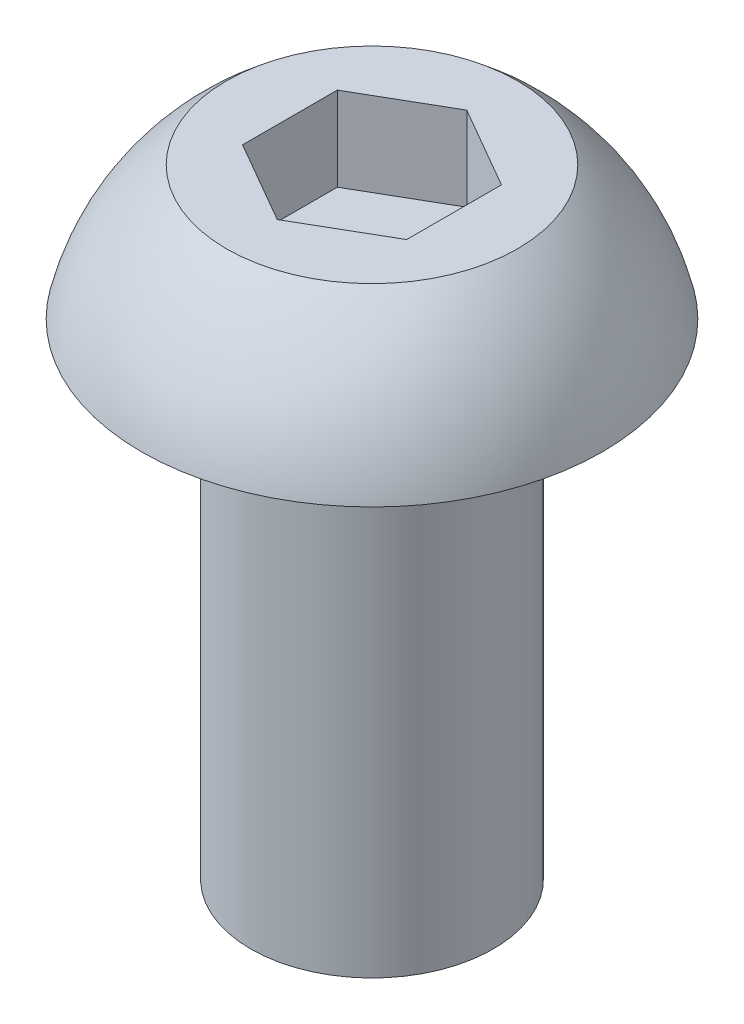
ISO-10303-21;
HEADER;
FILE_DESCRIPTION(('STEP AP214'),'2;1');
FILE_NAME('part.step','',(''),(''),'','','');
FILE_SCHEMA(('AUTOMOTIVE_DESIGN { 1 0 10303 214 1 1 1 1 }'));
ENDSEC;
DATA;
#1=APPLICATION_CONTEXT('core data for automotive mechanical design processes');
#2=APPLICATION_PROTOCOL_DEFINITION('international standard','automotive_design',2000,#1);
#3=PRODUCT_CONTEXT('',#1,'mechanical');
#4=PRODUCT('Part','Part','',(#3));
#5=PRODUCT_RELATED_PRODUCT_CATEGORY('part','',(#4));
#6=PRODUCT_DEFINITION_FORMATION('','',#4);
#7=PRODUCT_DEFINITION_CONTEXT('part definition',#1,'design');
#8=PRODUCT_DEFINITION('design','',#6,#7);
#9=PRODUCT_DEFINITION_SHAPE('','',#8);
#10=(LENGTH_UNIT() NAMED_UNIT(*) SI_UNIT(.MILLI.,.METRE.));
#11=(NAMED_UNIT(*) PLANE_ANGLE_UNIT() SI_UNIT($,.RADIAN.));
#12=(NAMED_UNIT(*) SI_UNIT($,.STERADIAN.) SOLID_ANGLE_UNIT());
#13=UNCERTAINTY_MEASURE_WITH_UNIT(LENGTH_MEASURE(1.E-05),#10,'distance_accuracy_value','');
#14=(GEOMETRIC_REPRESENTATION_CONTEXT(3) GLOBAL_UNCERTAINTY_ASSIGNED_CONTEXT((#13)) GLOBAL_UNIT_ASSIGNED_CONTEXT((#10,
#11,#12)) REPRESENTATION_CONTEXT('',''));
#15=CARTESIAN_POINT('',(0.,0.,0.));
#16=DIRECTION('',(0.,0.,1.));
#17=DIRECTION('',(1.,0.,0.));
#18=AXIS2_PLACEMENT_3D('',#15,#16,#17);
#19=CARTESIAN_POINT('',(0.,0.,0.));
#20=DIRECTION('',(0.,-1.,0.));
#21=DIRECTION('',(-1.,0.,0.));
#22=AXIS2_PLACEMENT_3D('',#19,#20,#21);
#23=SPHERICAL_SURFACE('',#22,2.92419728336959);
#24=CARTESIAN_POINT('',(0.,0.654545454545435,0.));
#25=DIRECTION('',(0.,-1.,0.));
#26=DIRECTION('',(0.,0.,-1.));
#27=AXIS2_PLACEMENT_3D('',#24,#25,#26);
#28=CIRCLE('',#27,2.85);
#29=CARTESIAN_POINT('',(0.,0.654545454545435,-2.85));
#30=VERTEX_POINT('',#29);
#31=EDGE_CURVE('E171',#30,#30,#28,.T.);
#32=ORIENTED_EDGE('',*,*,#31,.F.);
#33=EDGE_LOOP('',(#32));
#34=FACE_BOUND('',#33,.T.);
#35=CARTESIAN_POINT('',(0.,2.30454545454545,0.));
#36=DIRECTION('',(0.,-1.,0.));
#37=DIRECTION('',(0.,0.,-1.));
#38=AXIS2_PLACEMENT_3D('',#35,#36,#37);
#39=CIRCLE('',#38,1.8);
#40=CARTESIAN_POINT('',(0.,2.30454545454545,-1.8));
#41=VERTEX_POINT('',#40);
#42=EDGE_CURVE('E154',#41,#41,#39,.T.);
#43=ORIENTED_EDGE('',*,*,#42,.T.);
#44=EDGE_LOOP('',(#43));
#45=FACE_BOUND('',#44,.T.);
#46=ADVANCED_FACE('F39',(#34,#45),#23,.T.);
#47=CARTESIAN_POINT('',(-2.85,0.654545454545435,0.));
#48=DIRECTION('',(0.,1.,0.));
#49=DIRECTION('',(0.,0.,1.));
#50=AXIS2_PLACEMENT_3D('',#47,#48,#49);
#51=PLANE('',#50);
#52=CARTESIAN_POINT('',(0.,0.654545454545435,0.));
#53=DIRECTION('',(0.,1.,0.));
#54=DIRECTION('',(0.,0.,1.));
#55=AXIS2_PLACEMENT_3D('',#52,#53,#54);
#56=CIRCLE('',#55,1.6);
#57=CARTESIAN_POINT('',(0.,0.654545454545435,1.6));
#58=VERTEX_POINT('',#57);
#59=EDGE_CURVE('E11',#58,#58,#56,.T.);
#60=ORIENTED_EDGE('',*,*,#59,.T.);
#61=EDGE_LOOP('',(#60));
#62=FACE_BOUND('',#61,.T.);
#63=ORIENTED_EDGE('',*,*,#31,.T.);
#64=EDGE_LOOP('',(#63));
#65=FACE_BOUND('',#64,.T.);
#66=ADVANCED_FACE('F190',(#62,#65),#51,.F.);
#67=CARTESIAN_POINT('',(0.,0.,0.));
#68=DIRECTION('',(0.,-1.,0.));
#69=DIRECTION('',(0.,0.,-1.));
#70=AXIS2_PLACEMENT_3D('',#67,#68,#69);
#71=CYLINDRICAL_SURFACE('',#70,1.5);
#72=CARTESIAN_POINT('',(0.,0.554545454545435,0.));
#73=DIRECTION('',(0.,1.,0.));
#74=DIRECTION('',(0.,0.,1.));
#75=AXIS2_PLACEMENT_3D('',#72,#73,#74);
#76=CIRCLE('',#75,1.5);
#77=CARTESIAN_POINT('',(0.,0.554545454545435,1.5));
#78=VERTEX_POINT('',#77);
#79=EDGE_CURVE('E48',#78,#78,#76,.F.);
#80=ORIENTED_EDGE('',*,*,#79,.T.);
#81=EDGE_LOOP('',(#80));
#82=FACE_BOUND('',#81,.T.);
#83=CARTESIAN_POINT('',(0.,-5.34545454545456,0.));
#84=DIRECTION('',(0.,-1.,0.));
#85=DIRECTION('',(0.,0.,-1.));
#86=AXIS2_PLACEMENT_3D('',#83,#84,#85);
#87=CIRCLE('',#86,1.5);
#88=CARTESIAN_POINT('',(0.,-5.34545454545456,-1.5));
#89=VERTEX_POINT('',#88);
#90=EDGE_CURVE('E167',#89,#89,#87,.T.);
#91=ORIENTED_EDGE('',*,*,#90,.F.);
#92=EDGE_LOOP('',(#91));
#93=FACE_BOUND('',#92,.T.);
#94=ADVANCED_FACE('F178',(#82,#93),#71,.T.);
#95=CARTESIAN_POINT('',(0.,-5.34545454545456,0.));
#96=DIRECTION('',(0.,1.,0.));
#97=DIRECTION('',(0.,0.,1.));
#98=AXIS2_PLACEMENT_3D('',#95,#96,#97);
#99=PLANE('',#98);
#100=ORIENTED_EDGE('',*,*,#90,.T.);
#101=EDGE_LOOP('',(#100));
#102=FACE_BOUND('',#101,.T.);
#103=ADVANCED_FACE('F202',(#102),#99,.F.);
#104=CARTESIAN_POINT('',(0.,2.30454545454545,0.));
#105=DIRECTION('',(0.,-1.,0.));
#106=DIRECTION('',(0.,0.,-1.));
#107=AXIS2_PLACEMENT_3D('',#104,#105,#106);
#108=PLANE('',#107);
#109=DIRECTION('',(0.866025403784439,0.,-0.499999999999999));
#110=VECTOR('',#109,1.);
#111=CARTESIAN_POINT('',(0.,2.30454545454545,1.17202104645494));
#112=LINE('',#111,#110);
#113=CARTESIAN_POINT('',(0.,2.30454545454545,1.17202104645494));
#114=VERTEX_POINT('',#113);
#115=CARTESIAN_POINT('',(1.015,2.30454545454545,0.58601052322747));
#116=VERTEX_POINT('',#115);
#117=EDGE_CURVE('E135',#114,#116,#112,.T.);
#118=ORIENTED_EDGE('',*,*,#117,.F.);
#119=DIRECTION('',(0.866025403784439,0.,0.5));
#120=VECTOR('',#119,1.);
#121=CARTESIAN_POINT('',(-1.015,2.30454545454545,0.58601052322747));
#122=LINE('',#121,#120);
#123=CARTESIAN_POINT('',(-1.015,2.30454545454545,0.58601052322747));
#124=VERTEX_POINT('',#123);
#125=EDGE_CURVE('E55',#124,#114,#122,.T.);
#126=ORIENTED_EDGE('',*,*,#125,.F.);
#127=DIRECTION('',(0.,0.,1.));
#128=VECTOR('',#127,1.);
#129=CARTESIAN_POINT('',(-1.015,2.30454545454545,-0.586010523227472));
#130=LINE('',#129,#128);
#131=CARTESIAN_POINT('',(-1.015,2.30454545454545,-0.586010523227472));
#132=VERTEX_POINT('',#131);
#133=EDGE_CURVE('E148',#132,#124,#130,.T.);
#134=ORIENTED_EDGE('',*,*,#133,.F.);
#135=DIRECTION('',(-0.866025403784439,0.,0.499999999999999));
#136=VECTOR('',#135,1.);
#137=CARTESIAN_POINT('',(0.,2.30454545454545,-1.17202104645494));
#138=LINE('',#137,#136);
#139=CARTESIAN_POINT('',(0.,2.30454545454545,-1.17202104645494));
#140=VERTEX_POINT('',#139);
#141=EDGE_CURVE('E145',#140,#132,#138,.T.);
#142=ORIENTED_EDGE('',*,*,#141,.F.);
#143=DIRECTION('',(-0.866025403784439,0.,-0.5));
#144=VECTOR('',#143,1.);
#145=CARTESIAN_POINT('',(1.015,2.30454545454545,-0.586010523227475));
#146=LINE('',#145,#144);
#147=CARTESIAN_POINT('',(1.015,2.30454545454545,-0.586010523227475));
#148=VERTEX_POINT('',#147);
#149=EDGE_CURVE('E103',#148,#140,#146,.T.);
#150=ORIENTED_EDGE('',*,*,#149,.F.);
#151=DIRECTION('',(0.,0.,-1.));
#152=VECTOR('',#151,1.);
#153=CARTESIAN_POINT('',(1.015,2.30454545454545,0.58601052322747));
#154=LINE('',#153,#152);
#155=EDGE_CURVE('E139',#116,#148,#154,.T.);
#156=ORIENTED_EDGE('',*,*,#155,.F.);
#157=EDGE_LOOP('',(#118,#126,#134,#142,#150,#156));
#158=FACE_BOUND('',#157,.T.);
#159=ORIENTED_EDGE('',*,*,#42,.F.);
#160=EDGE_LOOP('',(#159));
#161=FACE_BOUND('',#160,.T.);
#162=ADVANCED_FACE('F205',(#158,#161),#108,.F.);
#163=CARTESIAN_POINT('',(-1.015,1.26454545454545,0.58601052322747));
#164=DIRECTION('',(-0.5,0.,0.866025403784439));
#165=DIRECTION('',(0.866025403784439,0.,0.5));
#166=AXIS2_PLACEMENT_3D('',#163,#164,#165);
#167=PLANE('',#166);
#168=ORIENTED_EDGE('',*,*,#125,.T.);
#169=DIRECTION('',(0.,1.,0.));
#170=VECTOR('',#169,1.);
#171=CARTESIAN_POINT('',(0.,1.26454545454545,1.17202104645494));
#172=LINE('',#171,#170);
#173=CARTESIAN_POINT('',(0.,1.26454545454545,1.17202104645494));
#174=VERTEX_POINT('',#173);
#175=EDGE_CURVE('E85',#174,#114,#172,.T.);
#176=ORIENTED_EDGE('',*,*,#175,.F.);
#177=DIRECTION('',(0.866025403784439,0.,0.5));
#178=VECTOR('',#177,1.);
#179=CARTESIAN_POINT('',(-1.015,1.26454545454545,0.58601052322747));
#180=LINE('',#179,#178);
#181=CARTESIAN_POINT('',(-1.015,1.26454545454545,0.58601052322747));
#182=VERTEX_POINT('',#181);
#183=EDGE_CURVE('E151',#182,#174,#180,.T.);
#184=ORIENTED_EDGE('',*,*,#183,.F.);
#185=DIRECTION('',(0.,1.,0.));
#186=VECTOR('',#185,1.);
#187=CARTESIAN_POINT('',(-1.015,1.26454545454545,0.58601052322747));
#188=LINE('',#187,#186);
#189=EDGE_CURVE('E63',#182,#124,#188,.T.);
#190=ORIENTED_EDGE('',*,*,#189,.T.);
#191=EDGE_LOOP('',(#168,#176,#184,#190));
#192=FACE_BOUND('',#191,.T.);
#193=ADVANCED_FACE('F209',(#192),#167,.F.);
#194=CARTESIAN_POINT('',(-1.015,1.26454545454545,-0.586010523227472));
#195=DIRECTION('',(-1.,0.,0.));
#196=DIRECTION('',(0.,0.,1.));
#197=AXIS2_PLACEMENT_3D('',#194,#195,#196);
#198=PLANE('',#197);
#199=ORIENTED_EDGE('',*,*,#133,.T.);
#200=ORIENTED_EDGE('',*,*,#189,.F.);
#201=DIRECTION('',(0.,0.,1.));
#202=VECTOR('',#201,1.);
#203=CARTESIAN_POINT('',(-1.015,1.26454545454545,-0.586010523227472));
#204=LINE('',#203,#202);
#205=CARTESIAN_POINT('',(-1.015,1.26454545454545,-0.586010523227472));
#206=VERTEX_POINT('',#205);
#207=EDGE_CURVE('E117',#206,#182,#204,.T.);
#208=ORIENTED_EDGE('',*,*,#207,.F.);
#209=DIRECTION('',(0.,1.,0.));
#210=VECTOR('',#209,1.);
#211=CARTESIAN_POINT('',(-1.015,1.26454545454545,-0.586010523227472));
#212=LINE('',#211,#210);
#213=EDGE_CURVE('E108',#206,#132,#212,.T.);
#214=ORIENTED_EDGE('',*,*,#213,.T.);
#215=EDGE_LOOP('',(#199,#200,#208,#214));
#216=FACE_BOUND('',#215,.T.);
#217=ADVANCED_FACE('F213',(#216),#198,.F.);
#218=CARTESIAN_POINT('',(0.,1.26454545454545,-1.17202104645494));
#219=DIRECTION('',(-0.499999999999999,0.,-0.866025403784439));
#220=DIRECTION('',(-0.866025403784439,0.,0.5));
#221=AXIS2_PLACEMENT_3D('',#218,#219,#220);
#222=PLANE('',#221);
#223=ORIENTED_EDGE('',*,*,#141,.T.);
#224=ORIENTED_EDGE('',*,*,#213,.F.);
#225=DIRECTION('',(-0.866025403784439,0.,0.499999999999999));
#226=VECTOR('',#225,1.);
#227=CARTESIAN_POINT('',(0.,1.26454545454545,-1.17202104645494));
#228=LINE('',#227,#226);
#229=CARTESIAN_POINT('',(0.,1.26454545454545,-1.17202104645494));
#230=VERTEX_POINT('',#229);
#231=EDGE_CURVE('E112',#230,#206,#228,.T.);
#232=ORIENTED_EDGE('',*,*,#231,.F.);
#233=DIRECTION('',(0.,1.,0.));
#234=VECTOR('',#233,1.);
#235=CARTESIAN_POINT('',(0.,1.26454545454545,-1.17202104645494));
#236=LINE('',#235,#234);
#237=EDGE_CURVE('E96',#230,#140,#236,.T.);
#238=ORIENTED_EDGE('',*,*,#237,.T.);
#239=EDGE_LOOP('',(#223,#224,#232,#238));
#240=FACE_BOUND('',#239,.T.);
#241=ADVANCED_FACE('F113',(#240),#222,.F.);
#242=CARTESIAN_POINT('',(1.015,1.26454545454545,-0.586010523227475));
#243=DIRECTION('',(0.5,0.,-0.866025403784439));
#244=DIRECTION('',(-0.866025403784439,0.,-0.5));
#245=AXIS2_PLACEMENT_3D('',#242,#243,#244);
#246=PLANE('',#245);
#247=ORIENTED_EDGE('',*,*,#149,.T.);
#248=ORIENTED_EDGE('',*,*,#237,.F.);
#249=DIRECTION('',(-0.866025403784439,0.,-0.5));
#250=VECTOR('',#249,1.);
#251=CARTESIAN_POINT('',(1.015,1.26454545454545,-0.586010523227475));
#252=LINE('',#251,#250);
#253=CARTESIAN_POINT('',(1.015,1.26454545454545,-0.586010523227475));
#254=VERTEX_POINT('',#253);
#255=EDGE_CURVE('E100',#254,#230,#252,.T.);
#256=ORIENTED_EDGE('',*,*,#255,.F.);
#257=DIRECTION('',(0.,1.,0.));
#258=VECTOR('',#257,1.);
#259=CARTESIAN_POINT('',(1.015,1.26454545454545,-0.586010523227475));
#260=LINE('',#259,#258);
#261=EDGE_CURVE('E109',#254,#148,#260,.T.);
#262=ORIENTED_EDGE('',*,*,#261,.T.);
#263=EDGE_LOOP('',(#247,#248,#256,#262));
#264=FACE_BOUND('',#263,.T.);
#265=ADVANCED_FACE('F98',(#264),#246,.F.);
#266=CARTESIAN_POINT('',(1.015,1.26454545454545,0.58601052322747));
#267=DIRECTION('',(1.,0.,0.));
#268=DIRECTION('',(0.,0.,-1.));
#269=AXIS2_PLACEMENT_3D('',#266,#267,#268);
#270=PLANE('',#269);
#271=ORIENTED_EDGE('',*,*,#155,.T.);
#272=ORIENTED_EDGE('',*,*,#261,.F.);
#273=DIRECTION('',(0.,0.,-1.));
#274=VECTOR('',#273,1.);
#275=CARTESIAN_POINT('',(1.015,1.26454545454545,0.58601052322747));
#276=LINE('',#275,#274);
#277=CARTESIAN_POINT('',(1.015,1.26454545454545,0.58601052322747));
#278=VERTEX_POINT('',#277);
#279=EDGE_CURVE('E123',#278,#254,#276,.T.);
#280=ORIENTED_EDGE('',*,*,#279,.F.);
#281=DIRECTION('',(0.,1.,0.));
#282=VECTOR('',#281,1.);
#283=CARTESIAN_POINT('',(1.015,1.26454545454545,0.58601052322747));
#284=LINE('',#283,#282);
#285=EDGE_CURVE('E159',#278,#116,#284,.T.);
#286=ORIENTED_EDGE('',*,*,#285,.T.);
#287=EDGE_LOOP('',(#271,#272,#280,#286));
#288=FACE_BOUND('',#287,.T.);
#289=ADVANCED_FACE('F216',(#288),#270,.F.);
#290=CARTESIAN_POINT('',(0.,1.26454545454545,1.17202104645494));
#291=DIRECTION('',(0.499999999999999,0.,0.866025403784439));
#292=DIRECTION('',(0.866025403784439,0.,-0.5));
#293=AXIS2_PLACEMENT_3D('',#290,#291,#292);
#294=PLANE('',#293);
#295=ORIENTED_EDGE('',*,*,#117,.T.);
#296=ORIENTED_EDGE('',*,*,#285,.F.);
#297=DIRECTION('',(0.866025403784439,0.,-0.499999999999999));
#298=VECTOR('',#297,1.);
#299=CARTESIAN_POINT('',(0.,1.26454545454545,1.17202104645494));
#300=LINE('',#299,#298);
#301=EDGE_CURVE('E127',#174,#278,#300,.T.);
#302=ORIENTED_EDGE('',*,*,#301,.F.);
#303=ORIENTED_EDGE('',*,*,#175,.T.);
#304=EDGE_LOOP('',(#295,#296,#302,#303));
#305=FACE_BOUND('',#304,.T.);
#306=ADVANCED_FACE('F186',(#305),#294,.F.);
#307=CARTESIAN_POINT('',(0.,1.26454545454545,0.));
#308=DIRECTION('',(0.,1.,0.));
#309=DIRECTION('',(0.,0.,1.));
#310=AXIS2_PLACEMENT_3D('',#307,#308,#309);
#311=PLANE('',#310);
#312=ORIENTED_EDGE('',*,*,#183,.T.);
#313=ORIENTED_EDGE('',*,*,#301,.T.);
#314=ORIENTED_EDGE('',*,*,#279,.T.);
#315=ORIENTED_EDGE('',*,*,#255,.T.);
#316=ORIENTED_EDGE('',*,*,#231,.T.);
#317=ORIENTED_EDGE('',*,*,#207,.T.);
#318=EDGE_LOOP('',(#312,#313,#314,#315,#316,#317));
#319=FACE_BOUND('',#318,.T.);
#320=ADVANCED_FACE('F120',(#319),#311,.T.);
#321=CARTESIAN_POINT('',(0.,0.554545454545435,0.));
#322=DIRECTION('',(0.,1.,0.));
#323=DIRECTION('',(0.,0.,1.));
#324=AXIS2_PLACEMENT_3D('',#321,#322,#323);
#325=TOROIDAL_SURFACE('',#324,1.6,0.1);
#326=ORIENTED_EDGE('',*,*,#59,.F.);
#327=EDGE_LOOP('',(#326));
#328=FACE_BOUND('',#327,.T.);
#329=ORIENTED_EDGE('',*,*,#79,.F.);
#330=EDGE_LOOP('',(#329));
#331=FACE_BOUND('',#330,.T.);
#332=ADVANCED_FACE('F41',(#328,#331),#325,.F.);
#333=CLOSED_SHELL('',(#46,#66,#94,#103,#162,#193,#217,#241,#265,#289,#306,#320,#332));
#334=MANIFOLD_SOLID_BREP('B2',#333);
#335=ADVANCED_BREP_SHAPE_REPRESENTATION('',(#18,#334),#14);
#336=SHAPE_DEFINITION_REPRESENTATION(#9,#335);
ENDSEC;
END-ISO-10303-21;
